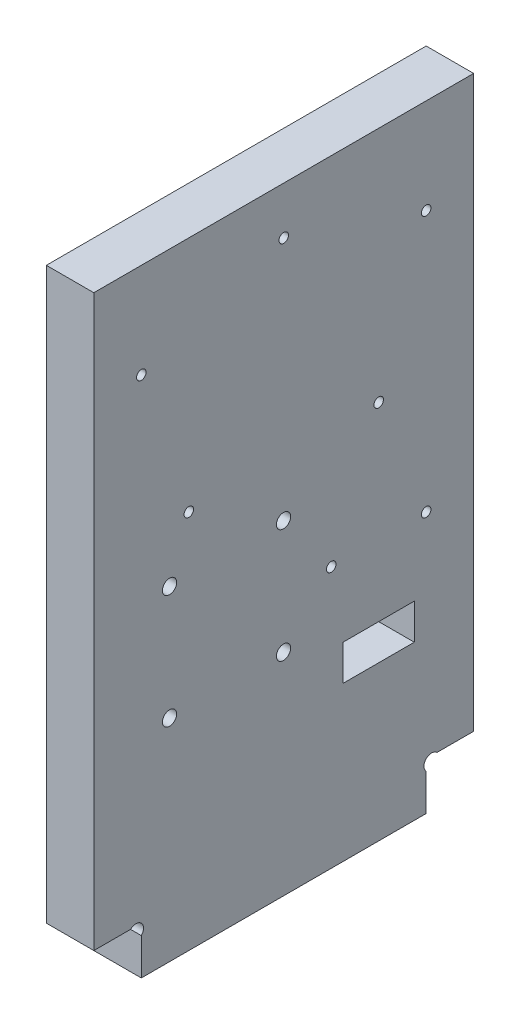
ISO-10303-21;
HEADER;
FILE_DESCRIPTION(('STEP AP214'),'2;1');
FILE_NAME('part.step','',(''),(''),'','','');
FILE_SCHEMA(('AUTOMOTIVE_DESIGN { 1 0 10303 214 1 1 1 1 }'));
ENDSEC;
DATA;
#1=APPLICATION_CONTEXT('core data for automotive mechanical design processes');
#2=APPLICATION_PROTOCOL_DEFINITION('international standard','automotive_design',2000,#1);
#3=PRODUCT_CONTEXT('',#1,'mechanical');
#4=PRODUCT('Part','Part','',(#3));
#5=PRODUCT_RELATED_PRODUCT_CATEGORY('part','',(#4));
#6=PRODUCT_DEFINITION_FORMATION('','',#4);
#7=PRODUCT_DEFINITION_CONTEXT('part definition',#1,'design');
#8=PRODUCT_DEFINITION('design','',#6,#7);
#9=PRODUCT_DEFINITION_SHAPE('','',#8);
#10=(LENGTH_UNIT() NAMED_UNIT(*) SI_UNIT(.MILLI.,.METRE.));
#11=(NAMED_UNIT(*) PLANE_ANGLE_UNIT() SI_UNIT($,.RADIAN.));
#12=(NAMED_UNIT(*) SI_UNIT($,.STERADIAN.) SOLID_ANGLE_UNIT());
#13=UNCERTAINTY_MEASURE_WITH_UNIT(LENGTH_MEASURE(1.E-05),#10,'distance_accuracy_value','');
#14=(GEOMETRIC_REPRESENTATION_CONTEXT(3) GLOBAL_UNCERTAINTY_ASSIGNED_CONTEXT((#13)) GLOBAL_UNIT_ASSIGNED_CONTEXT((#10,
#11,#12)) REPRESENTATION_CONTEXT('',''));
#15=CARTESIAN_POINT('',(0.,0.,0.));
#16=DIRECTION('',(0.,0.,1.));
#17=DIRECTION('',(1.,0.,0.));
#18=AXIS2_PLACEMENT_3D('',#15,#16,#17);
#19=CARTESIAN_POINT('',(10.,8.86862915010153,-8.86862915010152));
#20=DIRECTION('',(-1.,0.,0.));
#21=DIRECTION('',(0.,0.,1.));
#22=AXIS2_PLACEMENT_3D('',#19,#20,#21);
#23=CYLINDRICAL_SURFACE('',#22,1.6);
#24=CARTESIAN_POINT('',(0.,8.86862915010153,-8.86862915010152));
#25=DIRECTION('',(-1.,0.,0.));
#26=DIRECTION('',(0.,0.,-1.));
#27=AXIS2_PLACEMENT_3D('',#24,#25,#26);
#28=CIRCLE('',#27,1.6);
#29=CARTESIAN_POINT('',(0.,10.,-7.73725830020304));
#30=VERTEX_POINT('',#29);
#31=CARTESIAN_POINT('',(0.,7.73725830020305,-10.));
#32=VERTEX_POINT('',#31);
#33=EDGE_CURVE('E234',#30,#32,#28,.T.);
#34=ORIENTED_EDGE('',*,*,#33,.T.);
#35=DIRECTION('',(-1.,0.,0.));
#36=VECTOR('',#35,1.);
#37=CARTESIAN_POINT('',(10.,7.73725830020305,-10.));
#38=LINE('',#37,#36);
#39=CARTESIAN_POINT('',(10.,7.73725830020305,-10.));
#40=VERTEX_POINT('',#39);
#41=EDGE_CURVE('E11',#40,#32,#38,.T.);
#42=ORIENTED_EDGE('',*,*,#41,.F.);
#43=CARTESIAN_POINT('',(10.,8.86862915010153,-8.86862915010152));
#44=DIRECTION('',(-1.,0.,0.));
#45=DIRECTION('',(0.,0.,-1.));
#46=AXIS2_PLACEMENT_3D('',#43,#44,#45);
#47=CIRCLE('',#46,1.6);
#48=CARTESIAN_POINT('',(10.,10.,-7.73725830020304));
#49=VERTEX_POINT('',#48);
#50=EDGE_CURVE('E237',#49,#40,#47,.T.);
#51=ORIENTED_EDGE('',*,*,#50,.F.);
#52=DIRECTION('',(-1.,0.,0.));
#53=VECTOR('',#52,1.);
#54=CARTESIAN_POINT('',(10.,10.,-7.73725830020304));
#55=LINE('',#54,#53);
#56=EDGE_CURVE('E259',#49,#30,#55,.T.);
#57=ORIENTED_EDGE('',*,*,#56,.T.);
#58=EDGE_LOOP('',(#34,#42,#51,#57));
#59=FACE_BOUND('',#58,.T.);
#60=ADVANCED_FACE('F34',(#59),#23,.F.);
#61=CARTESIAN_POINT('',(10.,7.73725830020305,-10.));
#62=DIRECTION('',(0.,0.,-1.));
#63=DIRECTION('',(-1.,0.,0.));
#64=AXIS2_PLACEMENT_3D('',#61,#62,#63);
#65=PLANE('',#64);
#66=DIRECTION('',(0.,-1.,0.));
#67=VECTOR('',#66,1.);
#68=CARTESIAN_POINT('',(0.,7.73725830020305,-10.));
#69=LINE('',#68,#67);
#70=CARTESIAN_POINT('',(0.,0.,-10.));
#71=VERTEX_POINT('',#70);
#72=EDGE_CURVE('E262',#32,#71,#69,.T.);
#73=ORIENTED_EDGE('',*,*,#72,.T.);
#74=DIRECTION('',(-1.,0.,0.));
#75=VECTOR('',#74,1.);
#76=CARTESIAN_POINT('',(10.,0.,-10.));
#77=LINE('',#76,#75);
#78=CARTESIAN_POINT('',(10.,0.,-10.));
#79=VERTEX_POINT('',#78);
#80=EDGE_CURVE('E41',#79,#71,#77,.T.);
#81=ORIENTED_EDGE('',*,*,#80,.F.);
#82=DIRECTION('',(0.,-1.,0.));
#83=VECTOR('',#82,1.);
#84=CARTESIAN_POINT('',(10.,7.73725830020305,-10.));
#85=LINE('',#84,#83);
#86=EDGE_CURVE('E240',#40,#79,#85,.T.);
#87=ORIENTED_EDGE('',*,*,#86,.F.);
#88=ORIENTED_EDGE('',*,*,#41,.T.);
#89=EDGE_LOOP('',(#73,#81,#87,#88));
#90=FACE_BOUND('',#89,.T.);
#91=ADVANCED_FACE('F328',(#90),#65,.F.);
#92=CARTESIAN_POINT('',(10.,0.,-10.));
#93=DIRECTION('',(0.,1.,0.));
#94=DIRECTION('',(0.,0.,1.));
#95=AXIS2_PLACEMENT_3D('',#92,#93,#94);
#96=PLANE('',#95);
#97=DIRECTION('',(0.,0.,-1.));
#98=VECTOR('',#97,1.);
#99=CARTESIAN_POINT('',(0.,0.,-10.));
#100=LINE('',#99,#98);
#101=CARTESIAN_POINT('',(0.,0.,-70.));
#102=VERTEX_POINT('',#101);
#103=EDGE_CURVE('E264',#71,#102,#100,.T.);
#104=ORIENTED_EDGE('',*,*,#103,.T.);
#105=DIRECTION('',(-1.,0.,0.));
#106=VECTOR('',#105,1.);
#107=CARTESIAN_POINT('',(10.,0.,-70.));
#108=LINE('',#107,#106);
#109=CARTESIAN_POINT('',(10.,0.,-70.));
#110=VERTEX_POINT('',#109);
#111=EDGE_CURVE('E299',#110,#102,#108,.T.);
#112=ORIENTED_EDGE('',*,*,#111,.F.);
#113=DIRECTION('',(0.,0.,-1.));
#114=VECTOR('',#113,1.);
#115=CARTESIAN_POINT('',(10.,0.,-10.));
#116=LINE('',#115,#114);
#117=EDGE_CURVE('E243',#79,#110,#116,.T.);
#118=ORIENTED_EDGE('',*,*,#117,.F.);
#119=ORIENTED_EDGE('',*,*,#80,.T.);
#120=EDGE_LOOP('',(#104,#112,#118,#119));
#121=FACE_BOUND('',#120,.T.);
#122=ADVANCED_FACE('F306',(#121),#96,.F.);
#123=CARTESIAN_POINT('',(10.,7.73725830020305,-70.));
#124=DIRECTION('',(0.,0.,1.));
#125=DIRECTION('',(1.,0.,0.));
#126=AXIS2_PLACEMENT_3D('',#123,#124,#125);
#127=PLANE('',#126);
#128=DIRECTION('',(0.,1.,0.));
#129=VECTOR('',#128,1.);
#130=CARTESIAN_POINT('',(0.,7.73725830020305,-70.));
#131=LINE('',#130,#129);
#132=CARTESIAN_POINT('',(0.,7.73725830020305,-70.));
#133=VERTEX_POINT('',#132);
#134=EDGE_CURVE('E266',#102,#133,#131,.T.);
#135=ORIENTED_EDGE('',*,*,#134,.T.);
#136=DIRECTION('',(-1.,0.,0.));
#137=VECTOR('',#136,1.);
#138=CARTESIAN_POINT('',(10.,7.73725830020305,-70.));
#139=LINE('',#138,#137);
#140=CARTESIAN_POINT('',(10.,7.73725830020305,-70.));
#141=VERTEX_POINT('',#140);
#142=EDGE_CURVE('E296',#141,#133,#139,.T.);
#143=ORIENTED_EDGE('',*,*,#142,.F.);
#144=DIRECTION('',(0.,1.,0.));
#145=VECTOR('',#144,1.);
#146=CARTESIAN_POINT('',(10.,7.73725830020305,-70.));
#147=LINE('',#146,#145);
#148=EDGE_CURVE('E245',#110,#141,#147,.T.);
#149=ORIENTED_EDGE('',*,*,#148,.F.);
#150=ORIENTED_EDGE('',*,*,#111,.T.);
#151=EDGE_LOOP('',(#135,#143,#149,#150));
#152=FACE_BOUND('',#151,.T.);
#153=ADVANCED_FACE('F317',(#152),#127,.F.);
#154=CARTESIAN_POINT('',(10.,8.86862915010153,-71.1313708498985));
#155=DIRECTION('',(-1.,0.,0.));
#156=DIRECTION('',(0.,0.,1.));
#157=AXIS2_PLACEMENT_3D('',#154,#155,#156);
#158=CYLINDRICAL_SURFACE('',#157,1.6);
#159=CARTESIAN_POINT('',(0.,8.86862915010153,-71.1313708498985));
#160=DIRECTION('',(-1.,0.,0.));
#161=DIRECTION('',(0.,0.,1.));
#162=AXIS2_PLACEMENT_3D('',#159,#160,#161);
#163=CIRCLE('',#162,1.6);
#164=CARTESIAN_POINT('',(0.,10.,-72.262741699797));
#165=VERTEX_POINT('',#164);
#166=EDGE_CURVE('E268',#133,#165,#163,.T.);
#167=ORIENTED_EDGE('',*,*,#166,.T.);
#168=DIRECTION('',(-1.,0.,0.));
#169=VECTOR('',#168,1.);
#170=CARTESIAN_POINT('',(10.,10.,-72.262741699797));
#171=LINE('',#170,#169);
#172=CARTESIAN_POINT('',(10.,10.,-72.262741699797));
#173=VERTEX_POINT('',#172);
#174=EDGE_CURVE('E293',#173,#165,#171,.T.);
#175=ORIENTED_EDGE('',*,*,#174,.F.);
#176=CARTESIAN_POINT('',(10.,8.86862915010153,-71.1313708498985));
#177=DIRECTION('',(-1.,0.,0.));
#178=DIRECTION('',(0.,0.,1.));
#179=AXIS2_PLACEMENT_3D('',#176,#177,#178);
#180=CIRCLE('',#179,1.6);
#181=EDGE_CURVE('E247',#141,#173,#180,.T.);
#182=ORIENTED_EDGE('',*,*,#181,.F.);
#183=ORIENTED_EDGE('',*,*,#142,.T.);
#184=EDGE_LOOP('',(#167,#175,#182,#183));
#185=FACE_BOUND('',#184,.T.);
#186=ADVANCED_FACE('F321',(#185),#158,.F.);
#187=CARTESIAN_POINT('',(10.,10.,-72.262741699797));
#188=DIRECTION('',(0.,1.,0.));
#189=DIRECTION('',(0.,0.,1.));
#190=AXIS2_PLACEMENT_3D('',#187,#188,#189);
#191=PLANE('',#190);
#192=DIRECTION('',(0.,0.,-1.));
#193=VECTOR('',#192,1.);
#194=CARTESIAN_POINT('',(0.,10.,-72.262741699797));
#195=LINE('',#194,#193);
#196=CARTESIAN_POINT('',(0.,10.,-80.));
#197=VERTEX_POINT('',#196);
#198=EDGE_CURVE('E270',#165,#197,#195,.T.);
#199=ORIENTED_EDGE('',*,*,#198,.T.);
#200=DIRECTION('',(-1.,0.,0.));
#201=VECTOR('',#200,1.);
#202=CARTESIAN_POINT('',(10.,10.,-80.));
#203=LINE('',#202,#201);
#204=CARTESIAN_POINT('',(10.,10.,-80.));
#205=VERTEX_POINT('',#204);
#206=EDGE_CURVE('E290',#205,#197,#203,.T.);
#207=ORIENTED_EDGE('',*,*,#206,.F.);
#208=DIRECTION('',(0.,0.,-1.));
#209=VECTOR('',#208,1.);
#210=CARTESIAN_POINT('',(10.,10.,-72.262741699797));
#211=LINE('',#210,#209);
#212=EDGE_CURVE('E249',#173,#205,#211,.T.);
#213=ORIENTED_EDGE('',*,*,#212,.F.);
#214=ORIENTED_EDGE('',*,*,#174,.T.);
#215=EDGE_LOOP('',(#199,#207,#213,#214));
#216=FACE_BOUND('',#215,.T.);
#217=ADVANCED_FACE('F351',(#216),#191,.F.);
#218=CARTESIAN_POINT('',(10.,130.,-80.));
#219=DIRECTION('',(0.,0.,1.));
#220=DIRECTION('',(1.,0.,0.));
#221=AXIS2_PLACEMENT_3D('',#218,#219,#220);
#222=PLANE('',#221);
#223=DIRECTION('',(0.,1.,0.));
#224=VECTOR('',#223,1.);
#225=CARTESIAN_POINT('',(0.,130.,-80.));
#226=LINE('',#225,#224);
#227=CARTESIAN_POINT('',(0.,130.,-80.));
#228=VERTEX_POINT('',#227);
#229=EDGE_CURVE('E272',#197,#228,#226,.T.);
#230=ORIENTED_EDGE('',*,*,#229,.T.);
#231=DIRECTION('',(-1.,0.,0.));
#232=VECTOR('',#231,1.);
#233=CARTESIAN_POINT('',(10.,130.,-80.));
#234=LINE('',#233,#232);
#235=CARTESIAN_POINT('',(10.,130.,-80.));
#236=VERTEX_POINT('',#235);
#237=EDGE_CURVE('E287',#236,#228,#234,.T.);
#238=ORIENTED_EDGE('',*,*,#237,.F.);
#239=DIRECTION('',(0.,1.,0.));
#240=VECTOR('',#239,1.);
#241=CARTESIAN_POINT('',(10.,130.,-80.));
#242=LINE('',#241,#240);
#243=EDGE_CURVE('E251',#205,#236,#242,.T.);
#244=ORIENTED_EDGE('',*,*,#243,.F.);
#245=ORIENTED_EDGE('',*,*,#206,.T.);
#246=EDGE_LOOP('',(#230,#238,#244,#245));
#247=FACE_BOUND('',#246,.T.);
#248=ADVANCED_FACE('F348',(#247),#222,.F.);
#249=CARTESIAN_POINT('',(10.,130.,0.));
#250=DIRECTION('',(0.,-1.,0.));
#251=DIRECTION('',(0.,0.,-1.));
#252=AXIS2_PLACEMENT_3D('',#249,#250,#251);
#253=PLANE('',#252);
#254=DIRECTION('',(0.,0.,1.));
#255=VECTOR('',#254,1.);
#256=CARTESIAN_POINT('',(0.,130.,0.));
#257=LINE('',#256,#255);
#258=CARTESIAN_POINT('',(0.,130.,0.));
#259=VERTEX_POINT('',#258);
#260=EDGE_CURVE('E274',#228,#259,#257,.T.);
#261=ORIENTED_EDGE('',*,*,#260,.T.);
#262=DIRECTION('',(-1.,0.,0.));
#263=VECTOR('',#262,1.);
#264=CARTESIAN_POINT('',(10.,130.,0.));
#265=LINE('',#264,#263);
#266=CARTESIAN_POINT('',(10.,130.,0.));
#267=VERTEX_POINT('',#266);
#268=EDGE_CURVE('E284',#267,#259,#265,.T.);
#269=ORIENTED_EDGE('',*,*,#268,.F.);
#270=DIRECTION('',(0.,0.,1.));
#271=VECTOR('',#270,1.);
#272=CARTESIAN_POINT('',(10.,130.,0.));
#273=LINE('',#272,#271);
#274=EDGE_CURVE('E253',#236,#267,#273,.T.);
#275=ORIENTED_EDGE('',*,*,#274,.F.);
#276=ORIENTED_EDGE('',*,*,#237,.T.);
#277=EDGE_LOOP('',(#261,#269,#275,#276));
#278=FACE_BOUND('',#277,.T.);
#279=ADVANCED_FACE('F344',(#278),#253,.F.);
#280=CARTESIAN_POINT('',(10.,10.,0.));
#281=DIRECTION('',(0.,0.,-1.));
#282=DIRECTION('',(-1.,0.,0.));
#283=AXIS2_PLACEMENT_3D('',#280,#281,#282);
#284=PLANE('',#283);
#285=DIRECTION('',(0.,-1.,0.));
#286=VECTOR('',#285,1.);
#287=CARTESIAN_POINT('',(0.,10.,0.));
#288=LINE('',#287,#286);
#289=CARTESIAN_POINT('',(0.,10.,0.));
#290=VERTEX_POINT('',#289);
#291=EDGE_CURVE('E276',#259,#290,#288,.T.);
#292=ORIENTED_EDGE('',*,*,#291,.T.);
#293=DIRECTION('',(-1.,0.,0.));
#294=VECTOR('',#293,1.);
#295=CARTESIAN_POINT('',(10.,10.,0.));
#296=LINE('',#295,#294);
#297=CARTESIAN_POINT('',(10.,10.,0.));
#298=VERTEX_POINT('',#297);
#299=EDGE_CURVE('E281',#298,#290,#296,.T.);
#300=ORIENTED_EDGE('',*,*,#299,.F.);
#301=DIRECTION('',(0.,-1.,0.));
#302=VECTOR('',#301,1.);
#303=CARTESIAN_POINT('',(10.,10.,0.));
#304=LINE('',#303,#302);
#305=EDGE_CURVE('E255',#267,#298,#304,.T.);
#306=ORIENTED_EDGE('',*,*,#305,.F.);
#307=ORIENTED_EDGE('',*,*,#268,.T.);
#308=EDGE_LOOP('',(#292,#300,#306,#307));
#309=FACE_BOUND('',#308,.T.);
#310=ADVANCED_FACE('F340',(#309),#284,.F.);
#311=CARTESIAN_POINT('',(10.,10.,-7.73725830020304));
#312=DIRECTION('',(0.,1.,0.));
#313=DIRECTION('',(0.,0.,1.));
#314=AXIS2_PLACEMENT_3D('',#311,#312,#313);
#315=PLANE('',#314);
#316=DIRECTION('',(0.,0.,-1.));
#317=VECTOR('',#316,1.);
#318=CARTESIAN_POINT('',(0.,10.,-7.73725830020304));
#319=LINE('',#318,#317);
#320=EDGE_CURVE('E241',#290,#30,#319,.T.);
#321=ORIENTED_EDGE('',*,*,#320,.T.);
#322=ORIENTED_EDGE('',*,*,#56,.F.);
#323=DIRECTION('',(0.,0.,-1.));
#324=VECTOR('',#323,1.);
#325=CARTESIAN_POINT('',(10.,10.,-7.73725830020304));
#326=LINE('',#325,#324);
#327=EDGE_CURVE('E257',#298,#49,#326,.T.);
#328=ORIENTED_EDGE('',*,*,#327,.F.);
#329=ORIENTED_EDGE('',*,*,#299,.T.);
#330=EDGE_LOOP('',(#321,#322,#328,#329));
#331=FACE_BOUND('',#330,.T.);
#332=ADVANCED_FACE('F335',(#331),#315,.F.);
#333=CARTESIAN_POINT('',(10.,8.86862915010153,-8.86862915010152));
#334=DIRECTION('',(1.,0.,0.));
#335=DIRECTION('',(0.,0.,-1.));
#336=AXIS2_PLACEMENT_3D('',#333,#334,#335);
#337=PLANE('',#336);
#338=DIRECTION('',(0.,-1.,0.));
#339=VECTOR('',#338,1.);
#340=CARTESIAN_POINT('',(10.,40.,-67.5));
#341=LINE('',#340,#339);
#342=CARTESIAN_POINT('',(10.,40.,-67.5));
#343=VERTEX_POINT('',#342);
#344=CARTESIAN_POINT('',(10.,32.5,-67.5));
#345=VERTEX_POINT('',#344);
#346=EDGE_CURVE('E136',#343,#345,#341,.T.);
#347=ORIENTED_EDGE('',*,*,#346,.T.);
#348=DIRECTION('',(0.,0.,1.));
#349=VECTOR('',#348,1.);
#350=CARTESIAN_POINT('',(10.,32.5,-67.5));
#351=LINE('',#350,#349);
#352=CARTESIAN_POINT('',(10.,32.5,-52.5));
#353=VERTEX_POINT('',#352);
#354=EDGE_CURVE('E145',#345,#353,#351,.T.);
#355=ORIENTED_EDGE('',*,*,#354,.T.);
#356=DIRECTION('',(0.,1.,0.));
#357=VECTOR('',#356,1.);
#358=CARTESIAN_POINT('',(10.,40.,-52.5));
#359=LINE('',#358,#357);
#360=CARTESIAN_POINT('',(10.,40.,-52.5));
#361=VERTEX_POINT('',#360);
#362=EDGE_CURVE('E48',#353,#361,#359,.T.);
#363=ORIENTED_EDGE('',*,*,#362,.T.);
#364=DIRECTION('',(0.,0.,-1.));
#365=VECTOR('',#364,1.);
#366=CARTESIAN_POINT('',(10.,40.,-67.5));
#367=LINE('',#366,#365);
#368=EDGE_CURVE('E142',#361,#343,#367,.T.);
#369=ORIENTED_EDGE('',*,*,#368,.T.);
#370=EDGE_LOOP('',(#347,#355,#363,#369));
#371=FACE_BOUND('',#370,.T.);
#372=CARTESIAN_POINT('',(10.,68.45,-39.95));
#373=DIRECTION('',(1.,0.,0.));
#374=DIRECTION('',(0.,0.,-1.));
#375=AXIS2_PLACEMENT_3D('',#372,#373,#374);
#376=CIRCLE('',#375,1.5);
#377=CARTESIAN_POINT('',(10.,68.45,-41.45));
#378=VERTEX_POINT('',#377);
#379=EDGE_CURVE('E167',#378,#378,#376,.T.);
#380=ORIENTED_EDGE('',*,*,#379,.F.);
#381=EDGE_LOOP('',(#380));
#382=FACE_BOUND('',#381,.T.);
#383=CARTESIAN_POINT('',(10.,44.45,-39.95));
#384=DIRECTION('',(1.,0.,0.));
#385=DIRECTION('',(0.,0.,-1.));
#386=AXIS2_PLACEMENT_3D('',#383,#384,#385);
#387=CIRCLE('',#386,1.5);
#388=CARTESIAN_POINT('',(10.,44.45,-41.45));
#389=VERTEX_POINT('',#388);
#390=EDGE_CURVE('E174',#389,#389,#387,.T.);
#391=ORIENTED_EDGE('',*,*,#390,.F.);
#392=EDGE_LOOP('',(#391));
#393=FACE_BOUND('',#392,.T.);
#394=CARTESIAN_POINT('',(10.,44.45,-15.95));
#395=DIRECTION('',(1.,0.,0.));
#396=DIRECTION('',(0.,0.,-1.));
#397=AXIS2_PLACEMENT_3D('',#394,#395,#396);
#398=CIRCLE('',#397,1.5);
#399=CARTESIAN_POINT('',(10.,44.45,-17.45));
#400=VERTEX_POINT('',#399);
#401=EDGE_CURVE('E180',#400,#400,#398,.T.);
#402=ORIENTED_EDGE('',*,*,#401,.F.);
#403=EDGE_LOOP('',(#402));
#404=FACE_BOUND('',#403,.T.);
#405=CARTESIAN_POINT('',(10.,68.45,-15.95));
#406=DIRECTION('',(1.,0.,0.));
#407=DIRECTION('',(0.,0.,-1.));
#408=AXIS2_PLACEMENT_3D('',#405,#406,#407);
#409=CIRCLE('',#408,1.5);
#410=CARTESIAN_POINT('',(10.,68.45,-17.45));
#411=VERTEX_POINT('',#410);
#412=EDGE_CURVE('E186',#411,#411,#409,.T.);
#413=ORIENTED_EDGE('',*,*,#412,.F.);
#414=EDGE_LOOP('',(#413));
#415=FACE_BOUND('',#414,.T.);
#416=CARTESIAN_POINT('',(10.,120.,-40.));
#417=DIRECTION('',(1.,0.,0.));
#418=DIRECTION('',(0.,0.,-1.));
#419=AXIS2_PLACEMENT_3D('',#416,#417,#418);
#420=CIRCLE('',#419,0.999999999999998);
#421=CARTESIAN_POINT('',(10.,120.,-41.));
#422=VERTEX_POINT('',#421);
#423=EDGE_CURVE('E192',#422,#422,#420,.T.);
#424=ORIENTED_EDGE('',*,*,#423,.F.);
#425=EDGE_LOOP('',(#424));
#426=FACE_BOUND('',#425,.T.);
#427=CARTESIAN_POINT('',(10.,80.,-20.));
#428=DIRECTION('',(1.,0.,0.));
#429=DIRECTION('',(0.,0.,1.));
#430=AXIS2_PLACEMENT_3D('',#427,#428,#429);
#431=CIRCLE('',#430,1.);
#432=CARTESIAN_POINT('',(10.,80.,-19.));
#433=VERTEX_POINT('',#432);
#434=EDGE_CURVE('E198',#433,#433,#431,.T.);
#435=ORIENTED_EDGE('',*,*,#434,.F.);
#436=EDGE_LOOP('',(#435));
#437=FACE_BOUND('',#436,.T.);
#438=CARTESIAN_POINT('',(10.,55.,-70.));
#439=DIRECTION('',(1.,0.,0.));
#440=DIRECTION('',(0.,0.,-1.));
#441=AXIS2_PLACEMENT_3D('',#438,#439,#440);
#442=CIRCLE('',#441,0.999999999999998);
#443=CARTESIAN_POINT('',(10.,55.,-71.));
#444=VERTEX_POINT('',#443);
#445=EDGE_CURVE('E204',#444,#444,#442,.T.);
#446=ORIENTED_EDGE('',*,*,#445,.F.);
#447=EDGE_LOOP('',(#446));
#448=FACE_BOUND('',#447,.T.);
#449=CARTESIAN_POINT('',(10.,55.,-50.));
#450=DIRECTION('',(1.,0.,0.));
#451=DIRECTION('',(0.,0.,-1.));
#452=AXIS2_PLACEMENT_3D('',#449,#450,#451);
#453=CIRCLE('',#452,0.999999999999998);
#454=CARTESIAN_POINT('',(10.,55.,-51.));
#455=VERTEX_POINT('',#454);
#456=EDGE_CURVE('E210',#455,#455,#453,.T.);
#457=ORIENTED_EDGE('',*,*,#456,.F.);
#458=EDGE_LOOP('',(#457));
#459=FACE_BOUND('',#458,.T.);
#460=CARTESIAN_POINT('',(10.,110.,-70.));
#461=DIRECTION('',(1.,0.,0.));
#462=DIRECTION('',(0.,0.,-1.));
#463=AXIS2_PLACEMENT_3D('',#460,#461,#462);
#464=CIRCLE('',#463,0.999999999999998);
#465=CARTESIAN_POINT('',(10.,110.,-71.));
#466=VERTEX_POINT('',#465);
#467=EDGE_CURVE('E216',#466,#466,#464,.T.);
#468=ORIENTED_EDGE('',*,*,#467,.F.);
#469=EDGE_LOOP('',(#468));
#470=FACE_BOUND('',#469,.T.);
#471=CARTESIAN_POINT('',(10.,80.,-60.));
#472=DIRECTION('',(1.,0.,0.));
#473=DIRECTION('',(0.,0.,-1.));
#474=AXIS2_PLACEMENT_3D('',#471,#472,#473);
#475=CIRCLE('',#474,0.999999999999998);
#476=CARTESIAN_POINT('',(10.,80.,-61.));
#477=VERTEX_POINT('',#476);
#478=EDGE_CURVE('E222',#477,#477,#475,.T.);
#479=ORIENTED_EDGE('',*,*,#478,.F.);
#480=EDGE_LOOP('',(#479));
#481=FACE_BOUND('',#480,.T.);
#482=CARTESIAN_POINT('',(10.,110.,-10.));
#483=DIRECTION('',(1.,0.,0.));
#484=DIRECTION('',(0.,0.,-1.));
#485=AXIS2_PLACEMENT_3D('',#482,#483,#484);
#486=CIRCLE('',#485,1.);
#487=CARTESIAN_POINT('',(10.,110.,-11.));
#488=VERTEX_POINT('',#487);
#489=EDGE_CURVE('E228',#488,#488,#486,.T.);
#490=ORIENTED_EDGE('',*,*,#489,.F.);
#491=EDGE_LOOP('',(#490));
#492=FACE_BOUND('',#491,.T.);
#493=ORIENTED_EDGE('',*,*,#50,.T.);
#494=ORIENTED_EDGE('',*,*,#86,.T.);
#495=ORIENTED_EDGE('',*,*,#117,.T.);
#496=ORIENTED_EDGE('',*,*,#148,.T.);
#497=ORIENTED_EDGE('',*,*,#181,.T.);
#498=ORIENTED_EDGE('',*,*,#212,.T.);
#499=ORIENTED_EDGE('',*,*,#243,.T.);
#500=ORIENTED_EDGE('',*,*,#274,.T.);
#501=ORIENTED_EDGE('',*,*,#305,.T.);
#502=ORIENTED_EDGE('',*,*,#327,.T.);
#503=EDGE_LOOP('',(#493,#494,#495,#496,#497,#498,#499,#500,#501,#502));
#504=FACE_BOUND('',#503,.T.);
#505=ADVANCED_FACE('F149',(#371,#382,#393,#404,#415,#426,#437,#448,#459,#470,#481,#492,#504),
#337,.T.);
#506=CARTESIAN_POINT('',(0.,8.86862915010153,-8.86862915010152));
#507=DIRECTION('',(1.,0.,0.));
#508=DIRECTION('',(0.,0.,-1.));
#509=AXIS2_PLACEMENT_3D('',#506,#507,#508);
#510=PLANE('',#509);
#511=DIRECTION('',(0.,0.,1.));
#512=VECTOR('',#511,1.);
#513=CARTESIAN_POINT('',(0.,32.5,-67.5));
#514=LINE('',#513,#512);
#515=CARTESIAN_POINT('',(0.,32.5,-67.5));
#516=VERTEX_POINT('',#515);
#517=CARTESIAN_POINT('',(0.,32.5,-52.5));
#518=VERTEX_POINT('',#517);
#519=EDGE_CURVE('E161',#516,#518,#514,.T.);
#520=ORIENTED_EDGE('',*,*,#519,.F.);
#521=DIRECTION('',(0.,-1.,0.));
#522=VECTOR('',#521,1.);
#523=CARTESIAN_POINT('',(0.,40.,-67.5));
#524=LINE('',#523,#522);
#525=CARTESIAN_POINT('',(0.,40.,-67.5));
#526=VERTEX_POINT('',#525);
#527=EDGE_CURVE('E56',#526,#516,#524,.T.);
#528=ORIENTED_EDGE('',*,*,#527,.F.);
#529=DIRECTION('',(0.,0.,-1.));
#530=VECTOR('',#529,1.);
#531=CARTESIAN_POINT('',(0.,40.,-67.5));
#532=LINE('',#531,#530);
#533=CARTESIAN_POINT('',(0.,40.,-52.5));
#534=VERTEX_POINT('',#533);
#535=EDGE_CURVE('E152',#534,#526,#532,.T.);
#536=ORIENTED_EDGE('',*,*,#535,.F.);
#537=DIRECTION('',(0.,1.,0.));
#538=VECTOR('',#537,1.);
#539=CARTESIAN_POINT('',(0.,40.,-52.5));
#540=LINE('',#539,#538);
#541=EDGE_CURVE('E155',#518,#534,#540,.T.);
#542=ORIENTED_EDGE('',*,*,#541,.F.);
#543=EDGE_LOOP('',(#520,#528,#536,#542));
#544=FACE_BOUND('',#543,.T.);
#545=CARTESIAN_POINT('',(0.,68.45,-39.95));
#546=DIRECTION('',(1.,0.,0.));
#547=DIRECTION('',(0.,0.,-1.));
#548=AXIS2_PLACEMENT_3D('',#545,#546,#547);
#549=CIRCLE('',#548,1.5);
#550=CARTESIAN_POINT('',(0.,68.45,-41.45));
#551=VERTEX_POINT('',#550);
#552=EDGE_CURVE('E171',#551,#551,#549,.T.);
#553=ORIENTED_EDGE('',*,*,#552,.T.);
#554=EDGE_LOOP('',(#553));
#555=FACE_BOUND('',#554,.T.);
#556=CARTESIAN_POINT('',(0.,44.45,-39.95));
#557=DIRECTION('',(1.,0.,0.));
#558=DIRECTION('',(0.,0.,-1.));
#559=AXIS2_PLACEMENT_3D('',#556,#557,#558);
#560=CIRCLE('',#559,1.5);
#561=CARTESIAN_POINT('',(0.,44.45,-41.45));
#562=VERTEX_POINT('',#561);
#563=EDGE_CURVE('E177',#562,#562,#560,.T.);
#564=ORIENTED_EDGE('',*,*,#563,.T.);
#565=EDGE_LOOP('',(#564));
#566=FACE_BOUND('',#565,.T.);
#567=CARTESIAN_POINT('',(0.,44.45,-15.95));
#568=DIRECTION('',(1.,0.,0.));
#569=DIRECTION('',(0.,0.,-1.));
#570=AXIS2_PLACEMENT_3D('',#567,#568,#569);
#571=CIRCLE('',#570,1.5);
#572=CARTESIAN_POINT('',(0.,44.45,-17.45));
#573=VERTEX_POINT('',#572);
#574=EDGE_CURVE('E183',#573,#573,#571,.T.);
#575=ORIENTED_EDGE('',*,*,#574,.T.);
#576=EDGE_LOOP('',(#575));
#577=FACE_BOUND('',#576,.T.);
#578=CARTESIAN_POINT('',(0.,68.45,-15.95));
#579=DIRECTION('',(1.,0.,0.));
#580=DIRECTION('',(0.,0.,-1.));
#581=AXIS2_PLACEMENT_3D('',#578,#579,#580);
#582=CIRCLE('',#581,1.5);
#583=CARTESIAN_POINT('',(0.,68.45,-17.45));
#584=VERTEX_POINT('',#583);
#585=EDGE_CURVE('E189',#584,#584,#582,.T.);
#586=ORIENTED_EDGE('',*,*,#585,.T.);
#587=EDGE_LOOP('',(#586));
#588=FACE_BOUND('',#587,.T.);
#589=CARTESIAN_POINT('',(0.,120.,-40.));
#590=DIRECTION('',(1.,0.,0.));
#591=DIRECTION('',(0.,0.,-1.));
#592=AXIS2_PLACEMENT_3D('',#589,#590,#591);
#593=CIRCLE('',#592,0.999999999999998);
#594=CARTESIAN_POINT('',(0.,120.,-41.));
#595=VERTEX_POINT('',#594);
#596=EDGE_CURVE('E195',#595,#595,#593,.T.);
#597=ORIENTED_EDGE('',*,*,#596,.T.);
#598=EDGE_LOOP('',(#597));
#599=FACE_BOUND('',#598,.T.);
#600=CARTESIAN_POINT('',(0.,80.,-20.));
#601=DIRECTION('',(1.,0.,0.));
#602=DIRECTION('',(0.,0.,1.));
#603=AXIS2_PLACEMENT_3D('',#600,#601,#602);
#604=CIRCLE('',#603,1.);
#605=CARTESIAN_POINT('',(0.,80.,-19.));
#606=VERTEX_POINT('',#605);
#607=EDGE_CURVE('E201',#606,#606,#604,.T.);
#608=ORIENTED_EDGE('',*,*,#607,.T.);
#609=EDGE_LOOP('',(#608));
#610=FACE_BOUND('',#609,.T.);
#611=CARTESIAN_POINT('',(0.,55.,-70.));
#612=DIRECTION('',(1.,0.,0.));
#613=DIRECTION('',(0.,0.,-1.));
#614=AXIS2_PLACEMENT_3D('',#611,#612,#613);
#615=CIRCLE('',#614,0.999999999999998);
#616=CARTESIAN_POINT('',(0.,55.,-71.));
#617=VERTEX_POINT('',#616);
#618=EDGE_CURVE('E207',#617,#617,#615,.T.);
#619=ORIENTED_EDGE('',*,*,#618,.T.);
#620=EDGE_LOOP('',(#619));
#621=FACE_BOUND('',#620,.T.);
#622=CARTESIAN_POINT('',(0.,55.,-50.));
#623=DIRECTION('',(1.,0.,0.));
#624=DIRECTION('',(0.,0.,-1.));
#625=AXIS2_PLACEMENT_3D('',#622,#623,#624);
#626=CIRCLE('',#625,0.999999999999998);
#627=CARTESIAN_POINT('',(0.,55.,-51.));
#628=VERTEX_POINT('',#627);
#629=EDGE_CURVE('E213',#628,#628,#626,.T.);
#630=ORIENTED_EDGE('',*,*,#629,.T.);
#631=EDGE_LOOP('',(#630));
#632=FACE_BOUND('',#631,.T.);
#633=CARTESIAN_POINT('',(0.,110.,-70.));
#634=DIRECTION('',(1.,0.,0.));
#635=DIRECTION('',(0.,0.,-1.));
#636=AXIS2_PLACEMENT_3D('',#633,#634,#635);
#637=CIRCLE('',#636,0.999999999999998);
#638=CARTESIAN_POINT('',(0.,110.,-71.));
#639=VERTEX_POINT('',#638);
#640=EDGE_CURVE('E219',#639,#639,#637,.T.);
#641=ORIENTED_EDGE('',*,*,#640,.T.);
#642=EDGE_LOOP('',(#641));
#643=FACE_BOUND('',#642,.T.);
#644=CARTESIAN_POINT('',(0.,80.,-60.));
#645=DIRECTION('',(1.,0.,0.));
#646=DIRECTION('',(0.,0.,-1.));
#647=AXIS2_PLACEMENT_3D('',#644,#645,#646);
#648=CIRCLE('',#647,0.999999999999998);
#649=CARTESIAN_POINT('',(0.,80.,-61.));
#650=VERTEX_POINT('',#649);
#651=EDGE_CURVE('E225',#650,#650,#648,.T.);
#652=ORIENTED_EDGE('',*,*,#651,.T.);
#653=EDGE_LOOP('',(#652));
#654=FACE_BOUND('',#653,.T.);
#655=CARTESIAN_POINT('',(0.,110.,-10.));
#656=DIRECTION('',(1.,0.,0.));
#657=DIRECTION('',(0.,0.,-1.));
#658=AXIS2_PLACEMENT_3D('',#655,#656,#657);
#659=CIRCLE('',#658,1.);
#660=CARTESIAN_POINT('',(0.,110.,-11.));
#661=VERTEX_POINT('',#660);
#662=EDGE_CURVE('E231',#661,#661,#659,.T.);
#663=ORIENTED_EDGE('',*,*,#662,.T.);
#664=EDGE_LOOP('',(#663));
#665=FACE_BOUND('',#664,.T.);
#666=ORIENTED_EDGE('',*,*,#33,.F.);
#667=ORIENTED_EDGE('',*,*,#320,.F.);
#668=ORIENTED_EDGE('',*,*,#291,.F.);
#669=ORIENTED_EDGE('',*,*,#260,.F.);
#670=ORIENTED_EDGE('',*,*,#229,.F.);
#671=ORIENTED_EDGE('',*,*,#198,.F.);
#672=ORIENTED_EDGE('',*,*,#166,.F.);
#673=ORIENTED_EDGE('',*,*,#134,.F.);
#674=ORIENTED_EDGE('',*,*,#103,.F.);
#675=ORIENTED_EDGE('',*,*,#72,.F.);
#676=EDGE_LOOP('',(#666,#667,#668,#669,#670,#671,#672,#673,#674,#675));
#677=FACE_BOUND('',#676,.T.);
#678=ADVANCED_FACE('F312',(#544,#555,#566,#577,#588,#599,#610,#621,#632,#643,#654,#665,#677),
#510,.F.);
#679=CARTESIAN_POINT('',(0.,110.,-10.));
#680=DIRECTION('',(1.,0.,0.));
#681=DIRECTION('',(0.,0.,-1.));
#682=AXIS2_PLACEMENT_3D('',#679,#680,#681);
#683=CYLINDRICAL_SURFACE('',#682,1.);
#684=ORIENTED_EDGE('',*,*,#662,.F.);
#685=EDGE_LOOP('',(#684));
#686=FACE_BOUND('',#685,.T.);
#687=ORIENTED_EDGE('',*,*,#489,.T.);
#688=EDGE_LOOP('',(#687));
#689=FACE_BOUND('',#688,.T.);
#690=ADVANCED_FACE('F419',(#686,#689),#683,.F.);
#691=CARTESIAN_POINT('',(0.,80.,-60.));
#692=DIRECTION('',(1.,0.,0.));
#693=DIRECTION('',(0.,0.,-1.));
#694=AXIS2_PLACEMENT_3D('',#691,#692,#693);
#695=CYLINDRICAL_SURFACE('',#694,0.999999999999998);
#696=ORIENTED_EDGE('',*,*,#651,.F.);
#697=EDGE_LOOP('',(#696));
#698=FACE_BOUND('',#697,.T.);
#699=ORIENTED_EDGE('',*,*,#478,.T.);
#700=EDGE_LOOP('',(#699));
#701=FACE_BOUND('',#700,.T.);
#702=ADVANCED_FACE('F424',(#698,#701),#695,.F.);
#703=CARTESIAN_POINT('',(0.,110.,-70.));
#704=DIRECTION('',(1.,0.,0.));
#705=DIRECTION('',(0.,0.,-1.));
#706=AXIS2_PLACEMENT_3D('',#703,#704,#705);
#707=CYLINDRICAL_SURFACE('',#706,0.999999999999998);
#708=ORIENTED_EDGE('',*,*,#640,.F.);
#709=EDGE_LOOP('',(#708));
#710=FACE_BOUND('',#709,.T.);
#711=ORIENTED_EDGE('',*,*,#467,.T.);
#712=EDGE_LOOP('',(#711));
#713=FACE_BOUND('',#712,.T.);
#714=ADVANCED_FACE('F436',(#710,#713),#707,.F.);
#715=CARTESIAN_POINT('',(0.,55.,-50.));
#716=DIRECTION('',(1.,0.,0.));
#717=DIRECTION('',(0.,0.,-1.));
#718=AXIS2_PLACEMENT_3D('',#715,#716,#717);
#719=CYLINDRICAL_SURFACE('',#718,0.999999999999998);
#720=ORIENTED_EDGE('',*,*,#629,.F.);
#721=EDGE_LOOP('',(#720));
#722=FACE_BOUND('',#721,.T.);
#723=ORIENTED_EDGE('',*,*,#456,.T.);
#724=EDGE_LOOP('',(#723));
#725=FACE_BOUND('',#724,.T.);
#726=ADVANCED_FACE('F446',(#722,#725),#719,.F.);
#727=CARTESIAN_POINT('',(0.,55.,-70.));
#728=DIRECTION('',(1.,0.,0.));
#729=DIRECTION('',(0.,0.,-1.));
#730=AXIS2_PLACEMENT_3D('',#727,#728,#729);
#731=CYLINDRICAL_SURFACE('',#730,0.999999999999998);
#732=ORIENTED_EDGE('',*,*,#618,.F.);
#733=EDGE_LOOP('',(#732));
#734=FACE_BOUND('',#733,.T.);
#735=ORIENTED_EDGE('',*,*,#445,.T.);
#736=EDGE_LOOP('',(#735));
#737=FACE_BOUND('',#736,.T.);
#738=ADVANCED_FACE('F456',(#734,#737),#731,.F.);
#739=CARTESIAN_POINT('',(0.,80.,-20.));
#740=DIRECTION('',(1.,0.,0.));
#741=DIRECTION('',(0.,0.,-1.));
#742=AXIS2_PLACEMENT_3D('',#739,#740,#741);
#743=CYLINDRICAL_SURFACE('',#742,1.);
#744=ORIENTED_EDGE('',*,*,#607,.F.);
#745=EDGE_LOOP('',(#744));
#746=FACE_BOUND('',#745,.T.);
#747=ORIENTED_EDGE('',*,*,#434,.T.);
#748=EDGE_LOOP('',(#747));
#749=FACE_BOUND('',#748,.T.);
#750=ADVANCED_FACE('F466',(#746,#749),#743,.F.);
#751=CARTESIAN_POINT('',(0.,120.,-40.));
#752=DIRECTION('',(1.,0.,0.));
#753=DIRECTION('',(0.,0.,-1.));
#754=AXIS2_PLACEMENT_3D('',#751,#752,#753);
#755=CYLINDRICAL_SURFACE('',#754,0.999999999999998);
#756=ORIENTED_EDGE('',*,*,#596,.F.);
#757=EDGE_LOOP('',(#756));
#758=FACE_BOUND('',#757,.T.);
#759=ORIENTED_EDGE('',*,*,#423,.T.);
#760=EDGE_LOOP('',(#759));
#761=FACE_BOUND('',#760,.T.);
#762=ADVANCED_FACE('F476',(#758,#761),#755,.F.);
#763=CARTESIAN_POINT('',(0.,68.45,-15.95));
#764=DIRECTION('',(1.,0.,0.));
#765=DIRECTION('',(0.,0.,-1.));
#766=AXIS2_PLACEMENT_3D('',#763,#764,#765);
#767=CYLINDRICAL_SURFACE('',#766,1.5);
#768=ORIENTED_EDGE('',*,*,#585,.F.);
#769=EDGE_LOOP('',(#768));
#770=FACE_BOUND('',#769,.T.);
#771=ORIENTED_EDGE('',*,*,#412,.T.);
#772=EDGE_LOOP('',(#771));
#773=FACE_BOUND('',#772,.T.);
#774=ADVANCED_FACE('F486',(#770,#773),#767,.F.);
#775=CARTESIAN_POINT('',(0.,44.45,-15.95));
#776=DIRECTION('',(1.,0.,0.));
#777=DIRECTION('',(0.,0.,-1.));
#778=AXIS2_PLACEMENT_3D('',#775,#776,#777);
#779=CYLINDRICAL_SURFACE('',#778,1.5);
#780=ORIENTED_EDGE('',*,*,#574,.F.);
#781=EDGE_LOOP('',(#780));
#782=FACE_BOUND('',#781,.T.);
#783=ORIENTED_EDGE('',*,*,#401,.T.);
#784=EDGE_LOOP('',(#783));
#785=FACE_BOUND('',#784,.T.);
#786=ADVANCED_FACE('F496',(#782,#785),#779,.F.);
#787=CARTESIAN_POINT('',(0.,44.45,-39.95));
#788=DIRECTION('',(1.,0.,0.));
#789=DIRECTION('',(0.,0.,-1.));
#790=AXIS2_PLACEMENT_3D('',#787,#788,#789);
#791=CYLINDRICAL_SURFACE('',#790,1.5);
#792=ORIENTED_EDGE('',*,*,#563,.F.);
#793=EDGE_LOOP('',(#792));
#794=FACE_BOUND('',#793,.T.);
#795=ORIENTED_EDGE('',*,*,#390,.T.);
#796=EDGE_LOOP('',(#795));
#797=FACE_BOUND('',#796,.T.);
#798=ADVANCED_FACE('F506',(#794,#797),#791,.F.);
#799=CARTESIAN_POINT('',(0.,68.45,-39.95));
#800=DIRECTION('',(1.,0.,0.));
#801=DIRECTION('',(0.,0.,-1.));
#802=AXIS2_PLACEMENT_3D('',#799,#800,#801);
#803=CYLINDRICAL_SURFACE('',#802,1.5);
#804=ORIENTED_EDGE('',*,*,#552,.F.);
#805=EDGE_LOOP('',(#804));
#806=FACE_BOUND('',#805,.T.);
#807=ORIENTED_EDGE('',*,*,#379,.T.);
#808=EDGE_LOOP('',(#807));
#809=FACE_BOUND('',#808,.T.);
#810=ADVANCED_FACE('F516',(#806,#809),#803,.F.);
#811=CARTESIAN_POINT('',(10.,40.,-67.5));
#812=DIRECTION('',(0.,0.,-1.));
#813=DIRECTION('',(-1.,0.,0.));
#814=AXIS2_PLACEMENT_3D('',#811,#812,#813);
#815=PLANE('',#814);
#816=ORIENTED_EDGE('',*,*,#527,.T.);
#817=DIRECTION('',(-1.,0.,0.));
#818=VECTOR('',#817,1.);
#819=CARTESIAN_POINT('',(10.,32.5,-67.5));
#820=LINE('',#819,#818);
#821=EDGE_CURVE('E132',#345,#516,#820,.T.);
#822=ORIENTED_EDGE('',*,*,#821,.F.);
#823=ORIENTED_EDGE('',*,*,#346,.F.);
#824=DIRECTION('',(-1.,0.,0.));
#825=VECTOR('',#824,1.);
#826=CARTESIAN_POINT('',(10.,40.,-67.5));
#827=LINE('',#826,#825);
#828=EDGE_CURVE('E165',#343,#526,#827,.T.);
#829=ORIENTED_EDGE('',*,*,#828,.T.);
#830=EDGE_LOOP('',(#816,#822,#823,#829));
#831=FACE_BOUND('',#830,.T.);
#832=ADVANCED_FACE('F134',(#831),#815,.F.);
#833=CARTESIAN_POINT('',(10.,40.,-67.5));
#834=DIRECTION('',(0.,1.,0.));
#835=DIRECTION('',(0.,0.,1.));
#836=AXIS2_PLACEMENT_3D('',#833,#834,#835);
#837=PLANE('',#836);
#838=ORIENTED_EDGE('',*,*,#535,.T.);
#839=ORIENTED_EDGE('',*,*,#828,.F.);
#840=ORIENTED_EDGE('',*,*,#368,.F.);
#841=DIRECTION('',(-1.,0.,0.));
#842=VECTOR('',#841,1.);
#843=CARTESIAN_POINT('',(10.,40.,-52.5));
#844=LINE('',#843,#842);
#845=EDGE_CURVE('E168',#361,#534,#844,.T.);
#846=ORIENTED_EDGE('',*,*,#845,.T.);
#847=EDGE_LOOP('',(#838,#839,#840,#846));
#848=FACE_BOUND('',#847,.T.);
#849=ADVANCED_FACE('F544',(#848),#837,.F.);
#850=CARTESIAN_POINT('',(10.,40.,-52.5));
#851=DIRECTION('',(0.,0.,1.));
#852=DIRECTION('',(1.,0.,0.));
#853=AXIS2_PLACEMENT_3D('',#850,#851,#852);
#854=PLANE('',#853);
#855=ORIENTED_EDGE('',*,*,#541,.T.);
#856=ORIENTED_EDGE('',*,*,#845,.F.);
#857=ORIENTED_EDGE('',*,*,#362,.F.);
#858=DIRECTION('',(-1.,0.,0.));
#859=VECTOR('',#858,1.);
#860=CARTESIAN_POINT('',(10.,32.5,-52.5));
#861=LINE('',#860,#859);
#862=EDGE_CURVE('E141',#353,#518,#861,.T.);
#863=ORIENTED_EDGE('',*,*,#862,.T.);
#864=EDGE_LOOP('',(#855,#856,#857,#863));
#865=FACE_BOUND('',#864,.T.);
#866=ADVANCED_FACE('F553',(#865),#854,.F.);
#867=CARTESIAN_POINT('',(10.,32.5,-67.5));
#868=DIRECTION('',(0.,-1.,0.));
#869=DIRECTION('',(0.,0.,-1.));
#870=AXIS2_PLACEMENT_3D('',#867,#868,#869);
#871=PLANE('',#870);
#872=ORIENTED_EDGE('',*,*,#519,.T.);
#873=ORIENTED_EDGE('',*,*,#862,.F.);
#874=ORIENTED_EDGE('',*,*,#354,.F.);
#875=ORIENTED_EDGE('',*,*,#821,.T.);
#876=EDGE_LOOP('',(#872,#873,#874,#875));
#877=FACE_BOUND('',#876,.T.);
#878=ADVANCED_FACE('F146',(#877),#871,.F.);
#879=CLOSED_SHELL('',(#60,#91,#122,#153,#186,#217,#248,#279,#310,#332,#505,#678,#690,#702,#714,
#726,#738,#750,#762,#774,#786,#798,#810,#832,#849,#866,#878));
#880=MANIFOLD_SOLID_BREP('B2',#879);
#881=ADVANCED_BREP_SHAPE_REPRESENTATION('',(#18,#880),#14);
#882=SHAPE_DEFINITION_REPRESENTATION(#9,#881);
ENDSEC;
END-ISO-10303-21;
